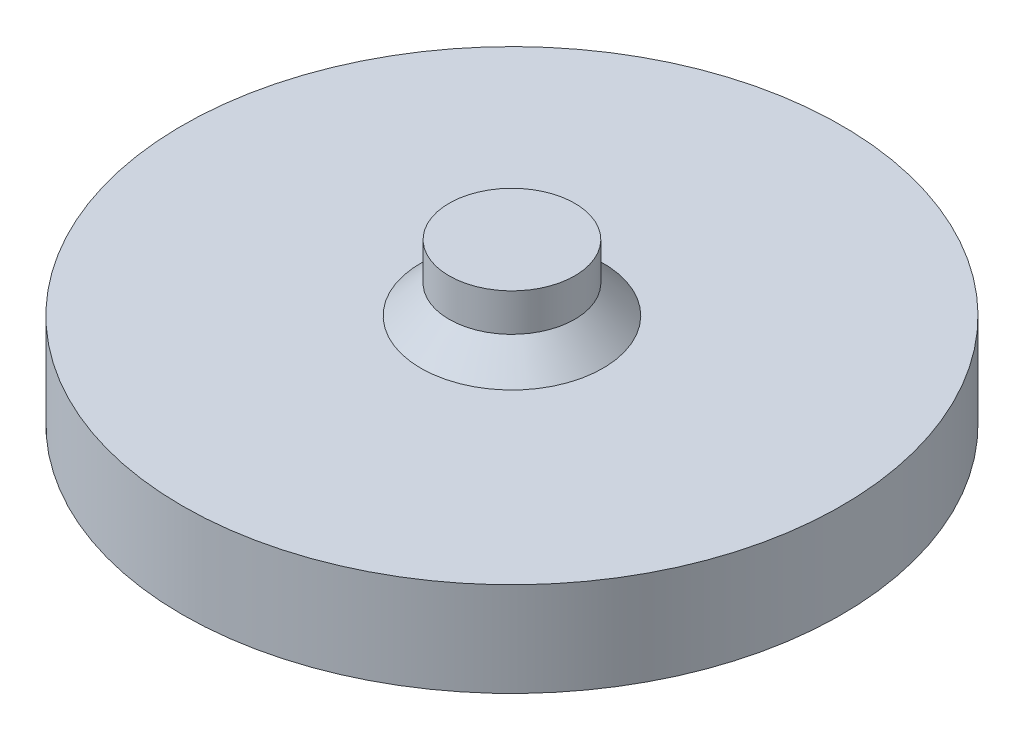
ISO-10303-21;
HEADER;
FILE_DESCRIPTION(('STEP AP214'),'2;1');
FILE_NAME('part.step','',(''),(''),'','','');
FILE_SCHEMA(('AUTOMOTIVE_DESIGN { 1 0 10303 214 1 1 1 1 }'));
ENDSEC;
DATA;
#1=APPLICATION_CONTEXT('core data for automotive mechanical design processes');
#2=APPLICATION_PROTOCOL_DEFINITION('international standard','automotive_design',2000,#1);
#3=PRODUCT_CONTEXT('',#1,'mechanical');
#4=PRODUCT('Part','Part','',(#3));
#5=PRODUCT_RELATED_PRODUCT_CATEGORY('part','',(#4));
#6=PRODUCT_DEFINITION_FORMATION('','',#4);
#7=PRODUCT_DEFINITION_CONTEXT('part definition',#1,'design');
#8=PRODUCT_DEFINITION('design','',#6,#7);
#9=PRODUCT_DEFINITION_SHAPE('','',#8);
#10=(LENGTH_UNIT() NAMED_UNIT(*) SI_UNIT(.MILLI.,.METRE.));
#11=(NAMED_UNIT(*) PLANE_ANGLE_UNIT() SI_UNIT($,.RADIAN.));
#12=(NAMED_UNIT(*) SI_UNIT($,.STERADIAN.) SOLID_ANGLE_UNIT());
#13=UNCERTAINTY_MEASURE_WITH_UNIT(LENGTH_MEASURE(1.E-05),#10,'distance_accuracy_value','');
#14=(GEOMETRIC_REPRESENTATION_CONTEXT(3) GLOBAL_UNCERTAINTY_ASSIGNED_CONTEXT((#13)) GLOBAL_UNIT_ASSIGNED_CONTEXT((#10,
#11,#12)) REPRESENTATION_CONTEXT('',''));
#15=CARTESIAN_POINT('',(0.,0.,0.));
#16=DIRECTION('',(0.,0.,1.));
#17=DIRECTION('',(1.,0.,0.));
#18=AXIS2_PLACEMENT_3D('',#15,#16,#17);
#19=CARTESIAN_POINT('',(0.,20.,0.));
#20=DIRECTION('',(0.,-1.,0.));
#21=DIRECTION('',(0.,0.,-1.));
#22=AXIS2_PLACEMENT_3D('',#19,#20,#21);
#23=CYLINDRICAL_SURFACE('',#22,70.);
#24=CARTESIAN_POINT('',(0.,20.,0.));
#25=DIRECTION('',(0.,1.,0.));
#26=DIRECTION('',(0.,0.,1.));
#27=AXIS2_PLACEMENT_3D('',#24,#25,#26);
#28=CIRCLE('',#27,70.);
#29=CARTESIAN_POINT('',(0.,20.,70.));
#30=VERTEX_POINT('',#29);
#31=EDGE_CURVE('E338',#30,#30,#28,.T.);
#32=ORIENTED_EDGE('',*,*,#31,.F.);
#33=EDGE_LOOP('',(#32));
#34=FACE_BOUND('',#33,.T.);
#35=CARTESIAN_POINT('',(0.,0.,0.));
#36=DIRECTION('',(0.,1.,0.));
#37=DIRECTION('',(0.,0.,1.));
#38=AXIS2_PLACEMENT_3D('',#35,#36,#37);
#39=CIRCLE('',#38,70.);
#40=CARTESIAN_POINT('',(0.,0.,70.));
#41=VERTEX_POINT('',#40);
#42=EDGE_CURVE('E331',#41,#41,#39,.T.);
#43=ORIENTED_EDGE('',*,*,#42,.T.);
#44=EDGE_LOOP('',(#43));
#45=FACE_BOUND('',#44,.T.);
#46=ADVANCED_FACE('F34',(#34,#45),#23,.T.);
#47=CARTESIAN_POINT('',(0.,20.,0.));
#48=DIRECTION('',(0.,1.,0.));
#49=DIRECTION('',(0.,0.,1.));
#50=AXIS2_PLACEMENT_3D('',#47,#48,#49);
#51=PLANE('',#50);
#52=CARTESIAN_POINT('',(0.,20.,0.));
#53=DIRECTION('',(0.,1.,0.));
#54=DIRECTION('',(0.,0.,1.));
#55=AXIS2_PLACEMENT_3D('',#52,#53,#54);
#56=CIRCLE('',#55,19.35);
#57=CARTESIAN_POINT('',(0.,20.,19.35));
#58=VERTEX_POINT('',#57);
#59=EDGE_CURVE('E11',#58,#58,#56,.F.);
#60=ORIENTED_EDGE('',*,*,#59,.T.);
#61=EDGE_LOOP('',(#60));
#62=FACE_BOUND('',#61,.T.);
#63=ORIENTED_EDGE('',*,*,#31,.T.);
#64=EDGE_LOOP('',(#63));
#65=FACE_BOUND('',#64,.T.);
#66=ADVANCED_FACE('F358',(#62,#65),#51,.T.);
#67=CARTESIAN_POINT('',(0.,0.,0.));
#68=DIRECTION('',(0.,1.,0.));
#69=DIRECTION('',(0.,0.,1.));
#70=AXIS2_PLACEMENT_3D('',#67,#68,#69);
#71=PLANE('',#70);
#72=DIRECTION('',(-0.866025403784439,0.,-0.499999999999999));
#73=VECTOR('',#72,1.);
#74=CARTESIAN_POINT('',(46.9304353138262,0.,31.7141016151458));
#75=LINE('',#74,#73);
#76=CARTESIAN_POINT('',(51.2605623327484,0.,34.2141016151458));
#77=VERTEX_POINT('',#76);
#78=CARTESIAN_POINT('',(46.9304353138262,0.,31.7141016151458));
#79=VERTEX_POINT('',#78);
#80=EDGE_CURVE('E202',#77,#79,#75,.T.);
#81=ORIENTED_EDGE('',*,*,#80,.F.);
#82=DIRECTION('',(-0.5,0.,0.866025403784439));
#83=VECTOR('',#82,1.);
#84=CARTESIAN_POINT('',(51.2605623327484,0.,34.2141016151458));
#85=LINE('',#84,#83);
#86=CARTESIAN_POINT('',(55.2605623327484,0.,27.2858983848702));
#87=VERTEX_POINT('',#86);
#88=EDGE_CURVE('E49',#87,#77,#85,.T.);
#89=ORIENTED_EDGE('',*,*,#88,.F.);
#90=DIRECTION('',(0.866025403784438,0.,0.5));
#91=VECTOR('',#90,1.);
#92=CARTESIAN_POINT('',(50.9304353138262,0.,24.7858983848702));
#93=LINE('',#92,#91);
#94=CARTESIAN_POINT('',(50.9304353138262,0.,24.7858983848702));
#95=VERTEX_POINT('',#94);
#96=EDGE_CURVE('E191',#95,#87,#93,.T.);
#97=ORIENTED_EDGE('',*,*,#96,.F.);
#98=DIRECTION('',(0.499999999999999,0.,-0.866025403784439));
#99=VECTOR('',#98,1.);
#100=CARTESIAN_POINT('',(46.9304353138262,0.,31.7141016151458));
#101=LINE('',#100,#99);
#102=EDGE_CURVE('E194',#79,#95,#101,.T.);
#103=ORIENTED_EDGE('',*,*,#102,.F.);
#104=EDGE_LOOP('',(#81,#89,#97,#103));
#105=FACE_BOUND('',#104,.T.);
#106=DIRECTION('',(-0.866025403784439,0.,0.5));
#107=VECTOR('',#106,1.);
#108=CARTESIAN_POINT('',(50.9304353138358,0.,-24.7858983848549));
#109=LINE('',#108,#107);
#110=CARTESIAN_POINT('',(55.260562332758,0.,-27.2858983848549));
#111=VERTEX_POINT('',#110);
#112=CARTESIAN_POINT('',(50.9304353138358,0.,-24.7858983848549));
#113=VERTEX_POINT('',#112);
#114=EDGE_CURVE('E228',#111,#113,#109,.T.);
#115=ORIENTED_EDGE('',*,*,#114,.F.);
#116=DIRECTION('',(0.5,0.,0.866025403784439));
#117=VECTOR('',#116,1.);
#118=CARTESIAN_POINT('',(55.260562332758,0.,-27.2858983848549));
#119=LINE('',#118,#117);
#120=CARTESIAN_POINT('',(51.260562332758,0.,-34.2141016151305));
#121=VERTEX_POINT('',#120);
#122=EDGE_CURVE('E57',#121,#111,#119,.T.);
#123=ORIENTED_EDGE('',*,*,#122,.F.);
#124=DIRECTION('',(0.86602540378444,0.,-0.499999999999998));
#125=VECTOR('',#124,1.);
#126=CARTESIAN_POINT('',(46.9304353138358,0.,-31.7141016151305));
#127=LINE('',#126,#125);
#128=CARTESIAN_POINT('',(46.9304353138358,0.,-31.7141016151305));
#129=VERTEX_POINT('',#128);
#130=EDGE_CURVE('E217',#129,#121,#127,.T.);
#131=ORIENTED_EDGE('',*,*,#130,.F.);
#132=DIRECTION('',(-0.499999999999999,0.,-0.866025403784439));
#133=VECTOR('',#132,1.);
#134=CARTESIAN_POINT('',(50.9304353138358,0.,-24.7858983848549));
#135=LINE('',#134,#133);
#136=EDGE_CURVE('E232',#113,#129,#135,.T.);
#137=ORIENTED_EDGE('',*,*,#136,.F.);
#138=EDGE_LOOP('',(#115,#123,#131,#137));
#139=FACE_BOUND('',#138,.T.);
#140=DIRECTION('',(0.866025403784439,0.,0.5));
#141=VECTOR('',#140,1.);
#142=CARTESIAN_POINT('',(-46.930435313807,0.,-31.7141016151472));
#143=LINE('',#142,#141);
#144=CARTESIAN_POINT('',(-51.2605623327291,0.,-34.2141016151472));
#145=VERTEX_POINT('',#144);
#146=CARTESIAN_POINT('',(-46.930435313807,0.,-31.7141016151472));
#147=VERTEX_POINT('',#146);
#148=EDGE_CURVE('E259',#145,#147,#143,.T.);
#149=ORIENTED_EDGE('',*,*,#148,.F.);
#150=DIRECTION('',(0.500000000000001,0.,-0.866025403784438));
#151=VECTOR('',#150,1.);
#152=CARTESIAN_POINT('',(-51.2605623327291,0.,-34.2141016151472));
#153=LINE('',#152,#151);
#154=CARTESIAN_POINT('',(-55.2605623327291,0.,-27.2858983848717));
#155=VERTEX_POINT('',#154);
#156=EDGE_CURVE('E257',#155,#145,#153,.T.);
#157=ORIENTED_EDGE('',*,*,#156,.F.);
#158=DIRECTION('',(-0.866025403784438,0.,-0.500000000000001));
#159=VECTOR('',#158,1.);
#160=CARTESIAN_POINT('',(-50.930435313807,0.,-24.7858983848717));
#161=LINE('',#160,#159);
#162=CARTESIAN_POINT('',(-50.930435313807,0.,-24.7858983848717));
#163=VERTEX_POINT('',#162);
#164=EDGE_CURVE('E247',#163,#155,#161,.T.);
#165=ORIENTED_EDGE('',*,*,#164,.F.);
#166=DIRECTION('',(-0.5,0.,0.866025403784438));
#167=VECTOR('',#166,1.);
#168=CARTESIAN_POINT('',(-46.930435313807,0.,-31.7141016151472));
#169=LINE('',#168,#167);
#170=EDGE_CURVE('E263',#147,#163,#169,.T.);
#171=ORIENTED_EDGE('',*,*,#170,.F.);
#172=EDGE_LOOP('',(#149,#157,#165,#171));
#173=FACE_BOUND('',#172,.T.);
#174=DIRECTION('',(0.866025403784439,0.,-0.499999999999999));
#175=VECTOR('',#174,1.);
#176=CARTESIAN_POINT('',(-50.9304353138166,0.,24.7858983848535));
#177=LINE('',#176,#175);
#178=CARTESIAN_POINT('',(-55.2605623327388,0.,27.2858983848535));
#179=VERTEX_POINT('',#178);
#180=CARTESIAN_POINT('',(-50.9304353138166,0.,24.7858983848535));
#181=VERTEX_POINT('',#180);
#182=EDGE_CURVE('E291',#179,#181,#177,.T.);
#183=ORIENTED_EDGE('',*,*,#182,.F.);
#184=DIRECTION('',(-0.5,0.,-0.866025403784439));
#185=VECTOR('',#184,1.);
#186=CARTESIAN_POINT('',(-55.2605623327388,0.,27.2858983848535));
#187=LINE('',#186,#185);
#188=CARTESIAN_POINT('',(-51.2605623327388,0.,34.214101615129));
#189=VERTEX_POINT('',#188);
#190=EDGE_CURVE('E289',#189,#179,#187,.T.);
#191=ORIENTED_EDGE('',*,*,#190,.F.);
#192=DIRECTION('',(-0.866025403784439,0.,0.499999999999999));
#193=VECTOR('',#192,1.);
#194=CARTESIAN_POINT('',(-46.9304353138166,0.,31.714101615129));
#195=LINE('',#194,#193);
#196=CARTESIAN_POINT('',(-46.9304353138166,0.,31.714101615129));
#197=VERTEX_POINT('',#196);
#198=EDGE_CURVE('E279',#197,#189,#195,.T.);
#199=ORIENTED_EDGE('',*,*,#198,.F.);
#200=DIRECTION('',(0.5,0.,0.866025403784439));
#201=VECTOR('',#200,1.);
#202=CARTESIAN_POINT('',(-50.9304353138166,0.,24.7858983848535));
#203=LINE('',#202,#201);
#204=EDGE_CURVE('E294',#181,#197,#203,.T.);
#205=ORIENTED_EDGE('',*,*,#204,.F.);
#206=EDGE_LOOP('',(#183,#191,#199,#205));
#207=FACE_BOUND('',#206,.T.);
#208=DIRECTION('',(-1.,0.,0.));
#209=VECTOR('',#208,1.);
#210=CARTESIAN_POINT('',(-4.00000000000001,0.,61.5));
#211=LINE('',#210,#209);
#212=CARTESIAN_POINT('',(3.99999999999999,0.,61.5));
#213=VERTEX_POINT('',#212);
#214=CARTESIAN_POINT('',(-4.00000000000001,0.,61.5));
#215=VERTEX_POINT('',#214);
#216=EDGE_CURVE('E321',#213,#215,#211,.T.);
#217=ORIENTED_EDGE('',*,*,#216,.F.);
#218=DIRECTION('',(0.,0.,1.));
#219=VECTOR('',#218,1.);
#220=CARTESIAN_POINT('',(3.99999999999999,0.,56.5));
#221=LINE('',#220,#219);
#222=CARTESIAN_POINT('',(3.99999999999999,0.,56.5));
#223=VERTEX_POINT('',#222);
#224=EDGE_CURVE('E209',#223,#213,#221,.T.);
#225=ORIENTED_EDGE('',*,*,#224,.F.);
#226=DIRECTION('',(1.,0.,0.));
#227=VECTOR('',#226,1.);
#228=CARTESIAN_POINT('',(-4.00000000000001,0.,56.5));
#229=LINE('',#228,#227);
#230=CARTESIAN_POINT('',(-4.00000000000001,0.,56.5));
#231=VERTEX_POINT('',#230);
#232=EDGE_CURVE('E310',#231,#223,#229,.T.);
#233=ORIENTED_EDGE('',*,*,#232,.F.);
#234=DIRECTION('',(0.,0.,-1.));
#235=VECTOR('',#234,1.);
#236=CARTESIAN_POINT('',(-4.00000000000001,0.,56.5));
#237=LINE('',#236,#235);
#238=EDGE_CURVE('E324',#215,#231,#237,.T.);
#239=ORIENTED_EDGE('',*,*,#238,.F.);
#240=EDGE_LOOP('',(#217,#225,#233,#239));
#241=FACE_BOUND('',#240,.T.);
#242=ORIENTED_EDGE('',*,*,#42,.F.);
#243=EDGE_LOOP('',(#242));
#244=FACE_BOUND('',#243,.T.);
#245=ADVANCED_FACE('F363',(#105,#139,#173,#207,#241,#244),#71,.F.);
#246=CARTESIAN_POINT('',(3.99999999999999,6.89,56.5));
#247=DIRECTION('',(1.,0.,0.));
#248=DIRECTION('',(0.,0.,-1.));
#249=AXIS2_PLACEMENT_3D('',#246,#247,#248);
#250=PLANE('',#249);
#251=ORIENTED_EDGE('',*,*,#224,.T.);
#252=DIRECTION('',(0.,-1.,0.));
#253=VECTOR('',#252,1.);
#254=CARTESIAN_POINT('',(3.99999999999999,6.89,61.5));
#255=LINE('',#254,#253);
#256=CARTESIAN_POINT('',(3.99999999999999,6.89,61.5));
#257=VERTEX_POINT('',#256);
#258=EDGE_CURVE('E319',#257,#213,#255,.T.);
#259=ORIENTED_EDGE('',*,*,#258,.F.);
#260=DIRECTION('',(0.,0.,1.));
#261=VECTOR('',#260,1.);
#262=CARTESIAN_POINT('',(3.99999999999999,6.89,56.5));
#263=LINE('',#262,#261);
#264=CARTESIAN_POINT('',(3.99999999999999,6.89,56.5));
#265=VERTEX_POINT('',#264);
#266=EDGE_CURVE('E306',#265,#257,#263,.T.);
#267=ORIENTED_EDGE('',*,*,#266,.F.);
#268=DIRECTION('',(0.,-1.,0.));
#269=VECTOR('',#268,1.);
#270=CARTESIAN_POINT('',(3.99999999999999,6.89,56.5));
#271=LINE('',#270,#269);
#272=EDGE_CURVE('E329',#265,#223,#271,.T.);
#273=ORIENTED_EDGE('',*,*,#272,.T.);
#274=EDGE_LOOP('',(#251,#259,#267,#273));
#275=FACE_BOUND('',#274,.T.);
#276=ADVANCED_FACE('F370',(#275),#250,.F.);
#277=CARTESIAN_POINT('',(-4.00000000000001,6.89,56.5));
#278=DIRECTION('',(0.,0.,-1.));
#279=DIRECTION('',(-1.,0.,0.));
#280=AXIS2_PLACEMENT_3D('',#277,#278,#279);
#281=PLANE('',#280);
#282=ORIENTED_EDGE('',*,*,#232,.T.);
#283=ORIENTED_EDGE('',*,*,#272,.F.);
#284=DIRECTION('',(1.,0.,0.));
#285=VECTOR('',#284,1.);
#286=CARTESIAN_POINT('',(-4.00000000000001,6.89,56.5));
#287=LINE('',#286,#285);
#288=CARTESIAN_POINT('',(-4.00000000000001,6.89,56.5));
#289=VERTEX_POINT('',#288);
#290=EDGE_CURVE('E316',#289,#265,#287,.T.);
#291=ORIENTED_EDGE('',*,*,#290,.F.);
#292=DIRECTION('',(0.,-1.,0.));
#293=VECTOR('',#292,1.);
#294=CARTESIAN_POINT('',(-4.00000000000001,6.89,56.5));
#295=LINE('',#294,#293);
#296=EDGE_CURVE('E332',#289,#231,#295,.T.);
#297=ORIENTED_EDGE('',*,*,#296,.T.);
#298=EDGE_LOOP('',(#282,#283,#291,#297));
#299=FACE_BOUND('',#298,.T.);
#300=ADVANCED_FACE('F375',(#299),#281,.F.);
#301=CARTESIAN_POINT('',(-4.00000000000001,6.89,56.5));
#302=DIRECTION('',(-1.,0.,0.));
#303=DIRECTION('',(0.,0.,1.));
#304=AXIS2_PLACEMENT_3D('',#301,#302,#303);
#305=PLANE('',#304);
#306=ORIENTED_EDGE('',*,*,#238,.T.);
#307=ORIENTED_EDGE('',*,*,#296,.F.);
#308=DIRECTION('',(0.,0.,-1.));
#309=VECTOR('',#308,1.);
#310=CARTESIAN_POINT('',(-4.00000000000001,6.89,56.5));
#311=LINE('',#310,#309);
#312=CARTESIAN_POINT('',(-4.00000000000001,6.89,61.5));
#313=VERTEX_POINT('',#312);
#314=EDGE_CURVE('E313',#313,#289,#311,.T.);
#315=ORIENTED_EDGE('',*,*,#314,.F.);
#316=DIRECTION('',(0.,-1.,0.));
#317=VECTOR('',#316,1.);
#318=CARTESIAN_POINT('',(-4.00000000000001,6.89,61.5));
#319=LINE('',#318,#317);
#320=EDGE_CURVE('E334',#313,#215,#319,.T.);
#321=ORIENTED_EDGE('',*,*,#320,.T.);
#322=EDGE_LOOP('',(#306,#307,#315,#321));
#323=FACE_BOUND('',#322,.T.);
#324=ADVANCED_FACE('F381',(#323),#305,.F.);
#325=CARTESIAN_POINT('',(-4.00000000000001,6.89,61.5));
#326=DIRECTION('',(0.,0.,1.));
#327=DIRECTION('',(1.,0.,0.));
#328=AXIS2_PLACEMENT_3D('',#325,#326,#327);
#329=PLANE('',#328);
#330=ORIENTED_EDGE('',*,*,#216,.T.);
#331=ORIENTED_EDGE('',*,*,#320,.F.);
#332=DIRECTION('',(-1.,0.,0.));
#333=VECTOR('',#332,1.);
#334=CARTESIAN_POINT('',(-4.00000000000001,6.89,61.5));
#335=LINE('',#334,#333);
#336=EDGE_CURVE('E309',#257,#313,#335,.T.);
#337=ORIENTED_EDGE('',*,*,#336,.F.);
#338=ORIENTED_EDGE('',*,*,#258,.T.);
#339=EDGE_LOOP('',(#330,#331,#337,#338));
#340=FACE_BOUND('',#339,.T.);
#341=ADVANCED_FACE('F377',(#340),#329,.F.);
#342=CARTESIAN_POINT('',(0.,6.89,0.));
#343=DIRECTION('',(0.,1.,0.));
#344=DIRECTION('',(0.,0.,1.));
#345=AXIS2_PLACEMENT_3D('',#342,#343,#344);
#346=PLANE('',#345);
#347=ORIENTED_EDGE('',*,*,#266,.T.);
#348=ORIENTED_EDGE('',*,*,#336,.T.);
#349=ORIENTED_EDGE('',*,*,#314,.T.);
#350=ORIENTED_EDGE('',*,*,#290,.T.);
#351=EDGE_LOOP('',(#347,#348,#349,#350));
#352=FACE_BOUND('',#351,.T.);
#353=ADVANCED_FACE('F380',(#352),#346,.F.);
#354=CARTESIAN_POINT('',(-55.2605623327388,6.89,27.2858983848535));
#355=DIRECTION('',(-0.866025403784439,0.,0.5));
#356=DIRECTION('',(0.5,0.,0.866025403784439));
#357=AXIS2_PLACEMENT_3D('',#354,#355,#356);
#358=PLANE('',#357);
#359=ORIENTED_EDGE('',*,*,#190,.T.);
#360=DIRECTION('',(0.,-1.,0.));
#361=VECTOR('',#360,1.);
#362=CARTESIAN_POINT('',(-55.2605623327388,6.89,27.2858983848535));
#363=LINE('',#362,#361);
#364=CARTESIAN_POINT('',(-55.2605623327388,6.89,27.2858983848535));
#365=VERTEX_POINT('',#364);
#366=EDGE_CURVE('E288',#365,#179,#363,.T.);
#367=ORIENTED_EDGE('',*,*,#366,.F.);
#368=DIRECTION('',(-0.5,0.,-0.866025403784439));
#369=VECTOR('',#368,1.);
#370=CARTESIAN_POINT('',(-55.2605623327388,6.89,27.2858983848535));
#371=LINE('',#370,#369);
#372=CARTESIAN_POINT('',(-51.2605623327388,6.89,34.214101615129));
#373=VERTEX_POINT('',#372);
#374=EDGE_CURVE('E275',#373,#365,#371,.T.);
#375=ORIENTED_EDGE('',*,*,#374,.F.);
#376=DIRECTION('',(0.,-1.,0.));
#377=VECTOR('',#376,1.);
#378=CARTESIAN_POINT('',(-51.2605623327388,6.89,34.214101615129));
#379=LINE('',#378,#377);
#380=EDGE_CURVE('E260',#373,#189,#379,.T.);
#381=ORIENTED_EDGE('',*,*,#380,.T.);
#382=EDGE_LOOP('',(#359,#367,#375,#381));
#383=FACE_BOUND('',#382,.T.);
#384=ADVANCED_FACE('F391',(#383),#358,.F.);
#385=CARTESIAN_POINT('',(-46.9304353138166,6.89,31.714101615129));
#386=DIRECTION('',(0.499999999999999,0.,0.866025403784439));
#387=DIRECTION('',(0.866025403784439,0.,-0.499999999999999));
#388=AXIS2_PLACEMENT_3D('',#385,#386,#387);
#389=PLANE('',#388);
#390=ORIENTED_EDGE('',*,*,#198,.T.);
#391=ORIENTED_EDGE('',*,*,#380,.F.);
#392=DIRECTION('',(-0.866025403784439,0.,0.499999999999999));
#393=VECTOR('',#392,1.);
#394=CARTESIAN_POINT('',(-46.9304353138166,6.89,31.714101615129));
#395=LINE('',#394,#393);
#396=CARTESIAN_POINT('',(-46.9304353138166,6.89,31.714101615129));
#397=VERTEX_POINT('',#396);
#398=EDGE_CURVE('E285',#397,#373,#395,.T.);
#399=ORIENTED_EDGE('',*,*,#398,.F.);
#400=DIRECTION('',(0.,-1.,0.));
#401=VECTOR('',#400,1.);
#402=CARTESIAN_POINT('',(-46.9304353138166,6.89,31.714101615129));
#403=LINE('',#402,#401);
#404=EDGE_CURVE('E300',#397,#197,#403,.T.);
#405=ORIENTED_EDGE('',*,*,#404,.T.);
#406=EDGE_LOOP('',(#390,#391,#399,#405));
#407=FACE_BOUND('',#406,.T.);
#408=ADVANCED_FACE('F395',(#407),#389,.F.);
#409=CARTESIAN_POINT('',(-50.9304353138166,6.89,24.7858983848535));
#410=DIRECTION('',(0.866025403784439,0.,-0.5));
#411=DIRECTION('',(-0.5,0.,-0.866025403784439));
#412=AXIS2_PLACEMENT_3D('',#409,#410,#411);
#413=PLANE('',#412);
#414=ORIENTED_EDGE('',*,*,#204,.T.);
#415=ORIENTED_EDGE('',*,*,#404,.F.);
#416=DIRECTION('',(0.5,0.,0.866025403784439));
#417=VECTOR('',#416,1.);
#418=CARTESIAN_POINT('',(-50.9304353138166,6.89,24.7858983848535));
#419=LINE('',#418,#417);
#420=CARTESIAN_POINT('',(-50.9304353138166,6.89,24.7858983848535));
#421=VERTEX_POINT('',#420);
#422=EDGE_CURVE('E282',#421,#397,#419,.T.);
#423=ORIENTED_EDGE('',*,*,#422,.F.);
#424=DIRECTION('',(0.,-1.,0.));
#425=VECTOR('',#424,1.);
#426=CARTESIAN_POINT('',(-50.9304353138166,6.89,24.7858983848535));
#427=LINE('',#426,#425);
#428=EDGE_CURVE('E302',#421,#181,#427,.T.);
#429=ORIENTED_EDGE('',*,*,#428,.T.);
#430=EDGE_LOOP('',(#414,#415,#423,#429));
#431=FACE_BOUND('',#430,.T.);
#432=ADVANCED_FACE('F401',(#431),#413,.F.);
#433=CARTESIAN_POINT('',(-50.9304353138166,6.89,24.7858983848535));
#434=DIRECTION('',(-0.499999999999999,0.,-0.866025403784439));
#435=DIRECTION('',(-0.866025403784439,0.,0.499999999999999));
#436=AXIS2_PLACEMENT_3D('',#433,#434,#435);
#437=PLANE('',#436);
#438=ORIENTED_EDGE('',*,*,#182,.T.);
#439=ORIENTED_EDGE('',*,*,#428,.F.);
#440=DIRECTION('',(0.866025403784439,0.,-0.499999999999999));
#441=VECTOR('',#440,1.);
#442=CARTESIAN_POINT('',(-50.9304353138166,6.89,24.7858983848535));
#443=LINE('',#442,#441);
#444=EDGE_CURVE('E278',#365,#421,#443,.T.);
#445=ORIENTED_EDGE('',*,*,#444,.F.);
#446=ORIENTED_EDGE('',*,*,#366,.T.);
#447=EDGE_LOOP('',(#438,#439,#445,#446));
#448=FACE_BOUND('',#447,.T.);
#449=ADVANCED_FACE('F397',(#448),#437,.F.);
#450=CARTESIAN_POINT('',(0.,6.89,0.));
#451=DIRECTION('',(0.,-1.,0.));
#452=DIRECTION('',(0.,0.,-1.));
#453=AXIS2_PLACEMENT_3D('',#450,#451,#452);
#454=PLANE('',#453);
#455=ORIENTED_EDGE('',*,*,#374,.T.);
#456=ORIENTED_EDGE('',*,*,#444,.T.);
#457=ORIENTED_EDGE('',*,*,#422,.T.);
#458=ORIENTED_EDGE('',*,*,#398,.T.);
#459=EDGE_LOOP('',(#455,#456,#457,#458));
#460=FACE_BOUND('',#459,.T.);
#461=ADVANCED_FACE('F400',(#460),#454,.T.);
#462=CARTESIAN_POINT('',(-51.2605623327291,6.89,-34.2141016151472));
#463=DIRECTION('',(-0.866025403784438,0.,-0.500000000000001));
#464=DIRECTION('',(-0.500000000000001,0.,0.866025403784438));
#465=AXIS2_PLACEMENT_3D('',#462,#463,#464);
#466=PLANE('',#465);
#467=ORIENTED_EDGE('',*,*,#156,.T.);
#468=DIRECTION('',(0.,-1.,0.));
#469=VECTOR('',#468,1.);
#470=CARTESIAN_POINT('',(-51.2605623327291,6.89,-34.2141016151472));
#471=LINE('',#470,#469);
#472=CARTESIAN_POINT('',(-51.2605623327291,6.89,-34.2141016151472));
#473=VERTEX_POINT('',#472);
#474=EDGE_CURVE('E256',#473,#145,#471,.T.);
#475=ORIENTED_EDGE('',*,*,#474,.F.);
#476=DIRECTION('',(0.500000000000001,0.,-0.866025403784438));
#477=VECTOR('',#476,1.);
#478=CARTESIAN_POINT('',(-51.2605623327291,6.89,-34.2141016151472));
#479=LINE('',#478,#477);
#480=CARTESIAN_POINT('',(-55.2605623327291,6.89,-27.2858983848717));
#481=VERTEX_POINT('',#480);
#482=EDGE_CURVE('E243',#481,#473,#479,.T.);
#483=ORIENTED_EDGE('',*,*,#482,.F.);
#484=DIRECTION('',(0.,-1.,0.));
#485=VECTOR('',#484,1.);
#486=CARTESIAN_POINT('',(-55.2605623327291,6.89,-27.2858983848717));
#487=LINE('',#486,#485);
#488=EDGE_CURVE('E229',#481,#155,#487,.T.);
#489=ORIENTED_EDGE('',*,*,#488,.T.);
#490=EDGE_LOOP('',(#467,#475,#483,#489));
#491=FACE_BOUND('',#490,.T.);
#492=ADVANCED_FACE('F411',(#491),#466,.F.);
#493=CARTESIAN_POINT('',(-50.930435313807,6.89,-24.7858983848717));
#494=DIRECTION('',(-0.500000000000001,0.,0.866025403784438));
#495=DIRECTION('',(0.866025403784438,0.,0.500000000000001));
#496=AXIS2_PLACEMENT_3D('',#493,#494,#495);
#497=PLANE('',#496);
#498=ORIENTED_EDGE('',*,*,#164,.T.);
#499=ORIENTED_EDGE('',*,*,#488,.F.);
#500=DIRECTION('',(-0.866025403784438,0.,-0.500000000000001));
#501=VECTOR('',#500,1.);
#502=CARTESIAN_POINT('',(-50.930435313807,6.89,-24.7858983848717));
#503=LINE('',#502,#501);
#504=CARTESIAN_POINT('',(-50.930435313807,6.89,-24.7858983848717));
#505=VERTEX_POINT('',#504);
#506=EDGE_CURVE('E253',#505,#481,#503,.T.);
#507=ORIENTED_EDGE('',*,*,#506,.F.);
#508=DIRECTION('',(0.,-1.,0.));
#509=VECTOR('',#508,1.);
#510=CARTESIAN_POINT('',(-50.930435313807,6.89,-24.7858983848717));
#511=LINE('',#510,#509);
#512=EDGE_CURVE('E269',#505,#163,#511,.T.);
#513=ORIENTED_EDGE('',*,*,#512,.T.);
#514=EDGE_LOOP('',(#498,#499,#507,#513));
#515=FACE_BOUND('',#514,.T.);
#516=ADVANCED_FACE('F415',(#515),#497,.F.);
#517=CARTESIAN_POINT('',(-46.930435313807,6.89,-31.7141016151472));
#518=DIRECTION('',(0.866025403784438,0.,0.5));
#519=DIRECTION('',(0.5,0.,-0.866025403784439));
#520=AXIS2_PLACEMENT_3D('',#517,#518,#519);
#521=PLANE('',#520);
#522=ORIENTED_EDGE('',*,*,#170,.T.);
#523=ORIENTED_EDGE('',*,*,#512,.F.);
#524=DIRECTION('',(-0.5,0.,0.866025403784438));
#525=VECTOR('',#524,1.);
#526=CARTESIAN_POINT('',(-46.930435313807,6.89,-31.7141016151472));
#527=LINE('',#526,#525);
#528=CARTESIAN_POINT('',(-46.930435313807,6.89,-31.7141016151472));
#529=VERTEX_POINT('',#528);
#530=EDGE_CURVE('E250',#529,#505,#527,.T.);
#531=ORIENTED_EDGE('',*,*,#530,.F.);
#532=DIRECTION('',(0.,-1.,0.));
#533=VECTOR('',#532,1.);
#534=CARTESIAN_POINT('',(-46.930435313807,6.89,-31.7141016151472));
#535=LINE('',#534,#533);
#536=EDGE_CURVE('E271',#529,#147,#535,.T.);
#537=ORIENTED_EDGE('',*,*,#536,.T.);
#538=EDGE_LOOP('',(#522,#523,#531,#537));
#539=FACE_BOUND('',#538,.T.);
#540=ADVANCED_FACE('F421',(#539),#521,.F.);
#541=CARTESIAN_POINT('',(-46.930435313807,6.89,-31.7141016151472));
#542=DIRECTION('',(0.5,0.,-0.866025403784439));
#543=DIRECTION('',(-0.866025403784439,0.,-0.5));
#544=AXIS2_PLACEMENT_3D('',#541,#542,#543);
#545=PLANE('',#544);
#546=ORIENTED_EDGE('',*,*,#148,.T.);
#547=ORIENTED_EDGE('',*,*,#536,.F.);
#548=DIRECTION('',(0.866025403784439,0.,0.5));
#549=VECTOR('',#548,1.);
#550=CARTESIAN_POINT('',(-46.930435313807,6.89,-31.7141016151472));
#551=LINE('',#550,#549);
#552=EDGE_CURVE('E246',#473,#529,#551,.T.);
#553=ORIENTED_EDGE('',*,*,#552,.F.);
#554=ORIENTED_EDGE('',*,*,#474,.T.);
#555=EDGE_LOOP('',(#546,#547,#553,#554));
#556=FACE_BOUND('',#555,.T.);
#557=ADVANCED_FACE('F417',(#556),#545,.F.);
#558=CARTESIAN_POINT('',(0.,6.89,0.));
#559=DIRECTION('',(0.,-1.,0.));
#560=DIRECTION('',(0.,0.,-1.));
#561=AXIS2_PLACEMENT_3D('',#558,#559,#560);
#562=PLANE('',#561);
#563=ORIENTED_EDGE('',*,*,#482,.T.);
#564=ORIENTED_EDGE('',*,*,#552,.T.);
#565=ORIENTED_EDGE('',*,*,#530,.T.);
#566=ORIENTED_EDGE('',*,*,#506,.T.);
#567=EDGE_LOOP('',(#563,#564,#565,#566));
#568=FACE_BOUND('',#567,.T.);
#569=ADVANCED_FACE('F420',(#568),#562,.T.);
#570=CARTESIAN_POINT('',(55.260562332758,6.89,-27.2858983848549));
#571=DIRECTION('',(0.866025403784439,0.,-0.5));
#572=DIRECTION('',(-0.5,0.,-0.866025403784439));
#573=AXIS2_PLACEMENT_3D('',#570,#571,#572);
#574=PLANE('',#573);
#575=ORIENTED_EDGE('',*,*,#122,.T.);
#576=DIRECTION('',(0.,-1.,0.));
#577=VECTOR('',#576,1.);
#578=CARTESIAN_POINT('',(55.260562332758,6.89,-27.2858983848549));
#579=LINE('',#578,#577);
#580=CARTESIAN_POINT('',(55.260562332758,6.89,-27.2858983848549));
#581=VERTEX_POINT('',#580);
#582=EDGE_CURVE('E226',#581,#111,#579,.T.);
#583=ORIENTED_EDGE('',*,*,#582,.F.);
#584=DIRECTION('',(0.5,0.,0.866025403784439));
#585=VECTOR('',#584,1.);
#586=CARTESIAN_POINT('',(55.260562332758,6.89,-27.2858983848549));
#587=LINE('',#586,#585);
#588=CARTESIAN_POINT('',(51.260562332758,6.89,-34.2141016151305));
#589=VERTEX_POINT('',#588);
#590=EDGE_CURVE('E213',#589,#581,#587,.T.);
#591=ORIENTED_EDGE('',*,*,#590,.F.);
#592=DIRECTION('',(0.,-1.,0.));
#593=VECTOR('',#592,1.);
#594=CARTESIAN_POINT('',(51.260562332758,6.89,-34.2141016151305));
#595=LINE('',#594,#593);
#596=EDGE_CURVE('E203',#589,#121,#595,.T.);
#597=ORIENTED_EDGE('',*,*,#596,.T.);
#598=EDGE_LOOP('',(#575,#583,#591,#597));
#599=FACE_BOUND('',#598,.T.);
#600=ADVANCED_FACE('F431',(#599),#574,.F.);
#601=CARTESIAN_POINT('',(46.9304353138358,6.89,-31.7141016151305));
#602=DIRECTION('',(-0.499999999999998,0.,-0.86602540378444));
#603=DIRECTION('',(-0.86602540378444,0.,0.499999999999998));
#604=AXIS2_PLACEMENT_3D('',#601,#602,#603);
#605=PLANE('',#604);
#606=ORIENTED_EDGE('',*,*,#130,.T.);
#607=ORIENTED_EDGE('',*,*,#596,.F.);
#608=DIRECTION('',(0.86602540378444,0.,-0.499999999999998));
#609=VECTOR('',#608,1.);
#610=CARTESIAN_POINT('',(46.9304353138358,6.89,-31.7141016151305));
#611=LINE('',#610,#609);
#612=CARTESIAN_POINT('',(46.9304353138358,6.89,-31.7141016151305));
#613=VERTEX_POINT('',#612);
#614=EDGE_CURVE('E223',#613,#589,#611,.T.);
#615=ORIENTED_EDGE('',*,*,#614,.F.);
#616=DIRECTION('',(0.,-1.,0.));
#617=VECTOR('',#616,1.);
#618=CARTESIAN_POINT('',(46.9304353138358,6.89,-31.7141016151305));
#619=LINE('',#618,#617);
#620=EDGE_CURVE('E238',#613,#129,#619,.T.);
#621=ORIENTED_EDGE('',*,*,#620,.T.);
#622=EDGE_LOOP('',(#606,#607,#615,#621));
#623=FACE_BOUND('',#622,.T.);
#624=ADVANCED_FACE('F435',(#623),#605,.F.);
#625=CARTESIAN_POINT('',(50.9304353138358,6.89,-24.7858983848549));
#626=DIRECTION('',(-0.866025403784439,0.,0.499999999999999));
#627=DIRECTION('',(0.499999999999999,0.,0.866025403784439));
#628=AXIS2_PLACEMENT_3D('',#625,#626,#627);
#629=PLANE('',#628);
#630=ORIENTED_EDGE('',*,*,#136,.T.);
#631=ORIENTED_EDGE('',*,*,#620,.F.);
#632=DIRECTION('',(-0.499999999999999,0.,-0.866025403784439));
#633=VECTOR('',#632,1.);
#634=CARTESIAN_POINT('',(50.9304353138358,6.89,-24.7858983848549));
#635=LINE('',#634,#633);
#636=CARTESIAN_POINT('',(50.9304353138358,6.89,-24.7858983848549));
#637=VERTEX_POINT('',#636);
#638=EDGE_CURVE('E220',#637,#613,#635,.T.);
#639=ORIENTED_EDGE('',*,*,#638,.F.);
#640=DIRECTION('',(0.,-1.,0.));
#641=VECTOR('',#640,1.);
#642=CARTESIAN_POINT('',(50.9304353138358,6.89,-24.7858983848549));
#643=LINE('',#642,#641);
#644=EDGE_CURVE('E240',#637,#113,#643,.T.);
#645=ORIENTED_EDGE('',*,*,#644,.T.);
#646=EDGE_LOOP('',(#630,#631,#639,#645));
#647=FACE_BOUND('',#646,.T.);
#648=ADVANCED_FACE('F440',(#647),#629,.F.);
#649=CARTESIAN_POINT('',(50.9304353138358,6.89,-24.7858983848549));
#650=DIRECTION('',(0.5,0.,0.866025403784439));
#651=DIRECTION('',(0.866025403784439,0.,-0.5));
#652=AXIS2_PLACEMENT_3D('',#649,#650,#651);
#653=PLANE('',#652);
#654=ORIENTED_EDGE('',*,*,#114,.T.);
#655=ORIENTED_EDGE('',*,*,#644,.F.);
#656=DIRECTION('',(-0.866025403784439,0.,0.5));
#657=VECTOR('',#656,1.);
#658=CARTESIAN_POINT('',(50.9304353138358,6.89,-24.7858983848549));
#659=LINE('',#658,#657);
#660=EDGE_CURVE('E216',#581,#637,#659,.T.);
#661=ORIENTED_EDGE('',*,*,#660,.F.);
#662=ORIENTED_EDGE('',*,*,#582,.T.);
#663=EDGE_LOOP('',(#654,#655,#661,#662));
#664=FACE_BOUND('',#663,.T.);
#665=ADVANCED_FACE('F436',(#664),#653,.F.);
#666=CARTESIAN_POINT('',(0.,6.89,0.));
#667=DIRECTION('',(0.,-1.,0.));
#668=DIRECTION('',(0.,0.,-1.));
#669=AXIS2_PLACEMENT_3D('',#666,#667,#668);
#670=PLANE('',#669);
#671=ORIENTED_EDGE('',*,*,#590,.T.);
#672=ORIENTED_EDGE('',*,*,#660,.T.);
#673=ORIENTED_EDGE('',*,*,#638,.T.);
#674=ORIENTED_EDGE('',*,*,#614,.T.);
#675=EDGE_LOOP('',(#671,#672,#673,#674));
#676=FACE_BOUND('',#675,.T.);
#677=ADVANCED_FACE('F439',(#676),#670,.T.);
#678=CARTESIAN_POINT('',(51.2605623327484,6.89,34.2141016151458));
#679=DIRECTION('',(0.866025403784439,0.,0.5));
#680=DIRECTION('',(0.5,0.,-0.866025403784439));
#681=AXIS2_PLACEMENT_3D('',#678,#679,#680);
#682=PLANE('',#681);
#683=ORIENTED_EDGE('',*,*,#88,.T.);
#684=DIRECTION('',(0.,-1.,0.));
#685=VECTOR('',#684,1.);
#686=CARTESIAN_POINT('',(51.2605623327484,6.89,34.2141016151458));
#687=LINE('',#686,#685);
#688=CARTESIAN_POINT('',(51.2605623327484,6.89,34.2141016151458));
#689=VERTEX_POINT('',#688);
#690=EDGE_CURVE('E169',#689,#77,#687,.T.);
#691=ORIENTED_EDGE('',*,*,#690,.F.);
#692=DIRECTION('',(-0.5,0.,0.866025403784439));
#693=VECTOR('',#692,1.);
#694=CARTESIAN_POINT('',(51.2605623327484,6.89,34.2141016151458));
#695=LINE('',#694,#693);
#696=CARTESIAN_POINT('',(55.2605623327484,6.89,27.2858983848702));
#697=VERTEX_POINT('',#696);
#698=EDGE_CURVE('E173',#697,#689,#695,.T.);
#699=ORIENTED_EDGE('',*,*,#698,.F.);
#700=DIRECTION('',(0.,-1.,0.));
#701=VECTOR('',#700,1.);
#702=CARTESIAN_POINT('',(55.2605623327484,6.89,27.2858983848702));
#703=LINE('',#702,#701);
#704=EDGE_CURVE('E207',#697,#87,#703,.T.);
#705=ORIENTED_EDGE('',*,*,#704,.T.);
#706=EDGE_LOOP('',(#683,#691,#699,#705));
#707=FACE_BOUND('',#706,.T.);
#708=ADVANCED_FACE('F171',(#707),#682,.F.);
#709=CARTESIAN_POINT('',(50.9304353138262,6.89,24.7858983848702));
#710=DIRECTION('',(0.5,0.,-0.866025403784438));
#711=DIRECTION('',(-0.866025403784439,0.,-0.5));
#712=AXIS2_PLACEMENT_3D('',#709,#710,#711);
#713=PLANE('',#712);
#714=ORIENTED_EDGE('',*,*,#96,.T.);
#715=ORIENTED_EDGE('',*,*,#704,.F.);
#716=DIRECTION('',(0.866025403784438,0.,0.5));
#717=VECTOR('',#716,1.);
#718=CARTESIAN_POINT('',(50.9304353138262,6.89,24.7858983848702));
#719=LINE('',#718,#717);
#720=CARTESIAN_POINT('',(50.9304353138262,6.89,24.7858983848702));
#721=VERTEX_POINT('',#720);
#722=EDGE_CURVE('E179',#721,#697,#719,.T.);
#723=ORIENTED_EDGE('',*,*,#722,.F.);
#724=DIRECTION('',(0.,-1.,0.));
#725=VECTOR('',#724,1.);
#726=CARTESIAN_POINT('',(50.9304353138262,6.89,24.7858983848702));
#727=LINE('',#726,#725);
#728=EDGE_CURVE('E210',#721,#95,#727,.T.);
#729=ORIENTED_EDGE('',*,*,#728,.T.);
#730=EDGE_LOOP('',(#714,#715,#723,#729));
#731=FACE_BOUND('',#730,.T.);
#732=ADVANCED_FACE('F453',(#731),#713,.F.);
#733=CARTESIAN_POINT('',(46.9304353138262,6.89,31.7141016151458));
#734=DIRECTION('',(-0.866025403784439,0.,-0.499999999999999));
#735=DIRECTION('',(-0.499999999999999,0.,0.866025403784439));
#736=AXIS2_PLACEMENT_3D('',#733,#734,#735);
#737=PLANE('',#736);
#738=ORIENTED_EDGE('',*,*,#102,.T.);
#739=ORIENTED_EDGE('',*,*,#728,.F.);
#740=DIRECTION('',(0.499999999999999,0.,-0.866025403784439));
#741=VECTOR('',#740,1.);
#742=CARTESIAN_POINT('',(46.9304353138262,6.89,31.7141016151458));
#743=LINE('',#742,#741);
#744=CARTESIAN_POINT('',(46.9304353138262,6.89,31.7141016151458));
#745=VERTEX_POINT('',#744);
#746=EDGE_CURVE('E187',#745,#721,#743,.T.);
#747=ORIENTED_EDGE('',*,*,#746,.F.);
#748=DIRECTION('',(0.,-1.,0.));
#749=VECTOR('',#748,1.);
#750=CARTESIAN_POINT('',(46.9304353138262,6.89,31.7141016151458));
#751=LINE('',#750,#749);
#752=EDGE_CURVE('E178',#745,#79,#751,.T.);
#753=ORIENTED_EDGE('',*,*,#752,.T.);
#754=EDGE_LOOP('',(#738,#739,#747,#753));
#755=FACE_BOUND('',#754,.T.);
#756=ADVANCED_FACE('F456',(#755),#737,.F.);
#757=CARTESIAN_POINT('',(46.9304353138262,6.89,31.7141016151458));
#758=DIRECTION('',(-0.499999999999999,0.,0.866025403784439));
#759=DIRECTION('',(0.866025403784439,0.,0.499999999999999));
#760=AXIS2_PLACEMENT_3D('',#757,#758,#759);
#761=PLANE('',#760);
#762=ORIENTED_EDGE('',*,*,#80,.T.);
#763=ORIENTED_EDGE('',*,*,#752,.F.);
#764=DIRECTION('',(-0.866025403784439,0.,-0.499999999999999));
#765=VECTOR('',#764,1.);
#766=CARTESIAN_POINT('',(46.9304353138262,6.89,31.7141016151458));
#767=LINE('',#766,#765);
#768=EDGE_CURVE('E182',#689,#745,#767,.T.);
#769=ORIENTED_EDGE('',*,*,#768,.F.);
#770=ORIENTED_EDGE('',*,*,#690,.T.);
#771=EDGE_LOOP('',(#762,#763,#769,#770));
#772=FACE_BOUND('',#771,.T.);
#773=ADVANCED_FACE('F183',(#772),#761,.F.);
#774=CARTESIAN_POINT('',(0.,6.89,0.));
#775=DIRECTION('',(0.,-1.,0.));
#776=DIRECTION('',(0.,0.,-1.));
#777=AXIS2_PLACEMENT_3D('',#774,#775,#776);
#778=PLANE('',#777);
#779=ORIENTED_EDGE('',*,*,#698,.T.);
#780=ORIENTED_EDGE('',*,*,#768,.T.);
#781=ORIENTED_EDGE('',*,*,#746,.T.);
#782=ORIENTED_EDGE('',*,*,#722,.T.);
#783=EDGE_LOOP('',(#779,#780,#781,#782));
#784=FACE_BOUND('',#783,.T.);
#785=ADVANCED_FACE('F189',(#784),#778,.T.);
#786=CARTESIAN_POINT('',(0.,34.,0.));
#787=DIRECTION('',(0.,-1.,0.));
#788=DIRECTION('',(0.,0.,-1.));
#789=AXIS2_PLACEMENT_3D('',#786,#787,#788);
#790=CYLINDRICAL_SURFACE('',#789,13.35);
#791=CARTESIAN_POINT('',(0.,26.,0.));
#792=DIRECTION('',(0.,1.,0.));
#793=DIRECTION('',(0.,0.,1.));
#794=AXIS2_PLACEMENT_3D('',#791,#792,#793);
#795=CIRCLE('',#794,13.35);
#796=CARTESIAN_POINT('',(0.,26.,13.35));
#797=VERTEX_POINT('',#796);
#798=EDGE_CURVE('E42',#797,#797,#795,.T.);
#799=ORIENTED_EDGE('',*,*,#798,.T.);
#800=EDGE_LOOP('',(#799));
#801=FACE_BOUND('',#800,.T.);
#802=CARTESIAN_POINT('',(0.,34.,0.));
#803=DIRECTION('',(0.,1.,0.));
#804=DIRECTION('',(0.,0.,1.));
#805=AXIS2_PLACEMENT_3D('',#802,#803,#804);
#806=CIRCLE('',#805,13.35);
#807=CARTESIAN_POINT('',(0.,34.,13.35));
#808=VERTEX_POINT('',#807);
#809=EDGE_CURVE('E197',#808,#808,#806,.T.);
#810=ORIENTED_EDGE('',*,*,#809,.F.);
#811=EDGE_LOOP('',(#810));
#812=FACE_BOUND('',#811,.T.);
#813=ADVANCED_FACE('F345',(#801,#812),#790,.T.);
#814=CARTESIAN_POINT('',(0.,34.,0.));
#815=DIRECTION('',(0.,1.,0.));
#816=DIRECTION('',(0.,0.,1.));
#817=AXIS2_PLACEMENT_3D('',#814,#815,#816);
#818=PLANE('',#817);
#819=ORIENTED_EDGE('',*,*,#809,.T.);
#820=EDGE_LOOP('',(#819));
#821=FACE_BOUND('',#820,.T.);
#822=ADVANCED_FACE('F349',(#821),#818,.T.);
#823=CARTESIAN_POINT('',(0.,26.,0.));
#824=DIRECTION('',(0.,-1.,0.));
#825=DIRECTION('',(0.,0.,-1.));
#826=AXIS2_PLACEMENT_3D('',#823,#824,#825);
#827=CONICAL_SURFACE('',#826,13.35,0.785398163397444);
#828=ORIENTED_EDGE('',*,*,#59,.F.);
#829=EDGE_LOOP('',(#828));
#830=FACE_BOUND('',#829,.T.);
#831=ORIENTED_EDGE('',*,*,#798,.F.);
#832=EDGE_LOOP('',(#831));
#833=FACE_BOUND('',#832,.T.);
#834=ADVANCED_FACE('F36',(#830,#833),#827,.T.);
#835=CLOSED_SHELL('',(#46,#66,#245,#276,#300,#324,#341,#353,#384,#408,#432,#449,#461,#492,#516,
#540,#557,#569,#600,#624,#648,#665,#677,#708,#732,#756,#773,#785,#813,#822,#834));
#836=MANIFOLD_SOLID_BREP('B2',#835);
#837=ADVANCED_BREP_SHAPE_REPRESENTATION('',(#18,#836),#14);
#838=SHAPE_DEFINITION_REPRESENTATION(#9,#837);
ENDSEC;
END-ISO-10303-21;
